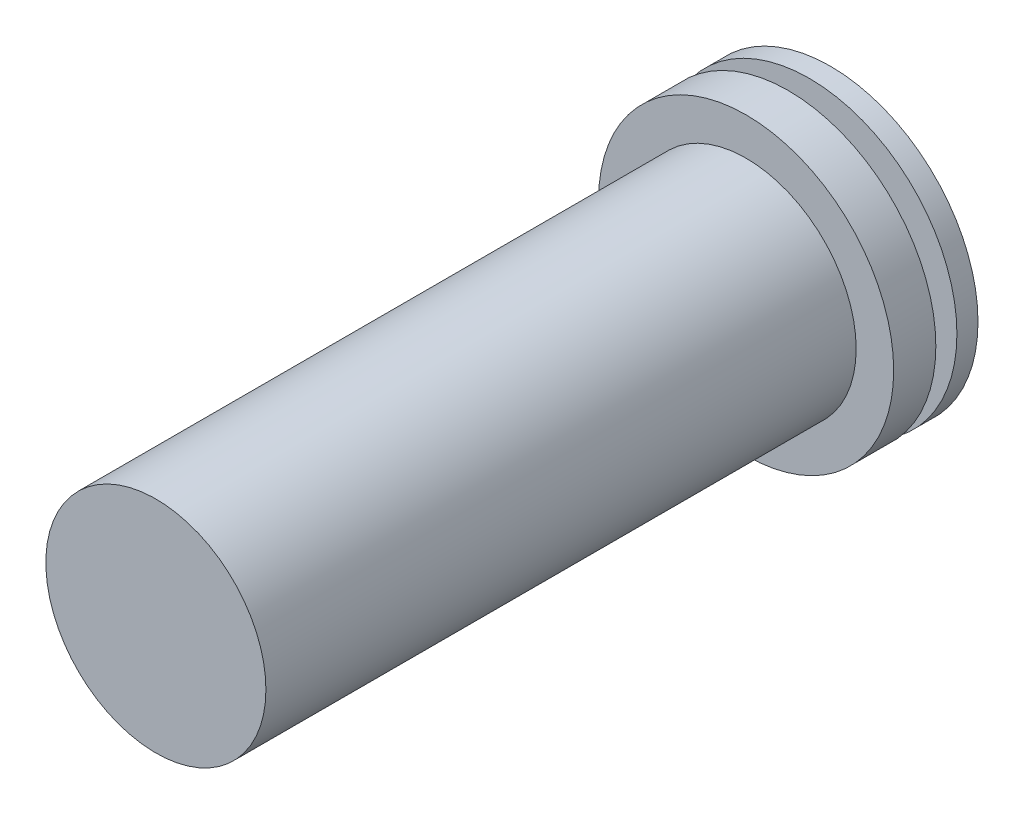
ISO-10303-21;
HEADER;
FILE_DESCRIPTION(('STEP AP214'),'2;1');
FILE_NAME('part.step','',(''),(''),'','','');
FILE_SCHEMA(('AUTOMOTIVE_DESIGN { 1 0 10303 214 1 1 1 1 }'));
ENDSEC;
DATA;
#1=APPLICATION_CONTEXT('core data for automotive mechanical design processes');
#2=APPLICATION_PROTOCOL_DEFINITION('international standard','automotive_design',2000,#1);
#3=PRODUCT_CONTEXT('',#1,'mechanical');
#4=PRODUCT('Part','Part','',(#3));
#5=PRODUCT_RELATED_PRODUCT_CATEGORY('part','',(#4));
#6=PRODUCT_DEFINITION_FORMATION('','',#4);
#7=PRODUCT_DEFINITION_CONTEXT('part definition',#1,'design');
#8=PRODUCT_DEFINITION('design','',#6,#7);
#9=PRODUCT_DEFINITION_SHAPE('','',#8);
#10=(LENGTH_UNIT() NAMED_UNIT(*) SI_UNIT(.MILLI.,.METRE.));
#11=(NAMED_UNIT(*) PLANE_ANGLE_UNIT() SI_UNIT($,.RADIAN.));
#12=(NAMED_UNIT(*) SI_UNIT($,.STERADIAN.) SOLID_ANGLE_UNIT());
#13=UNCERTAINTY_MEASURE_WITH_UNIT(LENGTH_MEASURE(1.E-05),#10,'distance_accuracy_value','');
#14=(GEOMETRIC_REPRESENTATION_CONTEXT(3) GLOBAL_UNCERTAINTY_ASSIGNED_CONTEXT((#13)) GLOBAL_UNIT_ASSIGNED_CONTEXT((#10,
#11,#12)) REPRESENTATION_CONTEXT('',''));
#15=CARTESIAN_POINT('',(0.,0.,0.));
#16=DIRECTION('',(0.,0.,1.));
#17=DIRECTION('',(1.,0.,0.));
#18=AXIS2_PLACEMENT_3D('',#15,#16,#17);
#19=CARTESIAN_POINT('',(0.,0.,-4.));
#20=DIRECTION('',(0.,0.,1.));
#21=DIRECTION('',(1.,0.,0.));
#22=AXIS2_PLACEMENT_3D('',#19,#20,#21);
#23=CYLINDRICAL_SURFACE('',#22,7.);
#24=CARTESIAN_POINT('',(0.,0.,0.));
#25=DIRECTION('',(0.,0.,-1.));
#26=DIRECTION('',(-1.,0.,0.));
#27=AXIS2_PLACEMENT_3D('',#24,#25,#26);
#28=CIRCLE('',#27,7.);
#29=CARTESIAN_POINT('',(-7.,0.,0.));
#30=VERTEX_POINT('',#29);
#31=EDGE_CURVE('E70',#30,#30,#28,.T.);
#32=ORIENTED_EDGE('',*,*,#31,.T.);
#33=EDGE_LOOP('',(#32));
#34=FACE_BOUND('',#33,.T.);
#35=CARTESIAN_POINT('',(0.,0.,-2.));
#36=DIRECTION('',(0.,0.,-1.));
#37=DIRECTION('',(-1.,0.,0.));
#38=AXIS2_PLACEMENT_3D('',#35,#36,#37);
#39=CIRCLE('',#38,7.);
#40=CARTESIAN_POINT('',(-7.,0.,-2.));
#41=VERTEX_POINT('',#40);
#42=EDGE_CURVE('E81',#41,#41,#39,.T.);
#43=ORIENTED_EDGE('',*,*,#42,.F.);
#44=EDGE_LOOP('',(#43));
#45=FACE_BOUND('',#44,.T.);
#46=ADVANCED_FACE('F55',(#34,#45),#23,.T.);
#47=CARTESIAN_POINT('',(0.,0.,28.));
#48=DIRECTION('',(0.,0.,-1.));
#49=DIRECTION('',(-1.,0.,0.));
#50=AXIS2_PLACEMENT_3D('',#47,#48,#49);
#51=CYLINDRICAL_SURFACE('',#50,5.22);
#52=CARTESIAN_POINT('',(0.,0.,28.));
#53=DIRECTION('',(0.,0.,1.));
#54=DIRECTION('',(1.,0.,0.));
#55=AXIS2_PLACEMENT_3D('',#52,#53,#54);
#56=CIRCLE('',#55,5.22);
#57=CARTESIAN_POINT('',(5.22,0.,28.));
#58=VERTEX_POINT('',#57);
#59=EDGE_CURVE('E11',#58,#58,#56,.T.);
#60=ORIENTED_EDGE('',*,*,#59,.F.);
#61=EDGE_LOOP('',(#60));
#62=FACE_BOUND('',#61,.T.);
#63=CARTESIAN_POINT('',(0.,0.,0.));
#64=DIRECTION('',(0.,0.,1.));
#65=DIRECTION('',(1.,0.,0.));
#66=AXIS2_PLACEMENT_3D('',#63,#64,#65);
#67=CIRCLE('',#66,5.22);
#68=CARTESIAN_POINT('',(5.22,0.,0.));
#69=VERTEX_POINT('',#68);
#70=EDGE_CURVE('E59',#69,#69,#67,.T.);
#71=ORIENTED_EDGE('',*,*,#70,.T.);
#72=EDGE_LOOP('',(#71));
#73=FACE_BOUND('',#72,.T.);
#74=ADVANCED_FACE('F57',(#62,#73),#51,.T.);
#75=CARTESIAN_POINT('',(0.,0.,28.));
#76=DIRECTION('',(0.,0.,1.));
#77=DIRECTION('',(1.,0.,0.));
#78=AXIS2_PLACEMENT_3D('',#75,#76,#77);
#79=PLANE('',#78);
#80=ORIENTED_EDGE('',*,*,#59,.T.);
#81=EDGE_LOOP('',(#80));
#82=FACE_BOUND('',#81,.T.);
#83=ADVANCED_FACE('F112',(#82),#79,.T.);
#84=CARTESIAN_POINT('',(0.,0.,0.));
#85=DIRECTION('',(0.,0.,-1.));
#86=DIRECTION('',(-1.,0.,0.));
#87=AXIS2_PLACEMENT_3D('',#84,#85,#86);
#88=PLANE('',#87);
#89=ORIENTED_EDGE('',*,*,#70,.F.);
#90=EDGE_LOOP('',(#89));
#91=FACE_BOUND('',#90,.T.);
#92=ORIENTED_EDGE('',*,*,#31,.F.);
#93=EDGE_LOOP('',(#92));
#94=FACE_BOUND('',#93,.T.);
#95=ADVANCED_FACE('F101',(#91,#94),#88,.F.);
#96=CARTESIAN_POINT('',(0.,0.,-2.));
#97=DIRECTION('',(0.,0.,-1.));
#98=DIRECTION('',(-1.,0.,0.));
#99=AXIS2_PLACEMENT_3D('',#96,#97,#98);
#100=PLANE('',#99);
#101=CARTESIAN_POINT('',(0.,0.,-2.));
#102=DIRECTION('',(0.,0.,-1.));
#103=DIRECTION('',(-1.,0.,0.));
#104=AXIS2_PLACEMENT_3D('',#101,#102,#103);
#105=CIRCLE('',#104,5.165);
#106=CARTESIAN_POINT('',(-5.165,0.,-2.));
#107=VERTEX_POINT('',#106);
#108=EDGE_CURVE('E89',#107,#107,#105,.T.);
#109=ORIENTED_EDGE('',*,*,#108,.F.);
#110=EDGE_LOOP('',(#109));
#111=FACE_BOUND('',#110,.T.);
#112=ORIENTED_EDGE('',*,*,#42,.T.);
#113=EDGE_LOOP('',(#112));
#114=FACE_BOUND('',#113,.T.);
#115=ADVANCED_FACE('F97',(#111,#114),#100,.T.);
#116=CARTESIAN_POINT('',(0.,0.,-3.));
#117=DIRECTION('',(0.,0.,-1.));
#118=DIRECTION('',(-1.,0.,0.));
#119=AXIS2_PLACEMENT_3D('',#116,#117,#118);
#120=PLANE('',#119);
#121=CARTESIAN_POINT('',(0.,0.,-3.));
#122=DIRECTION('',(0.,0.,-1.));
#123=DIRECTION('',(-1.,0.,0.));
#124=AXIS2_PLACEMENT_3D('',#121,#122,#123);
#125=CIRCLE('',#124,5.165);
#126=CARTESIAN_POINT('',(-5.165,0.,-3.));
#127=VERTEX_POINT('',#126);
#128=EDGE_CURVE('E85',#127,#127,#125,.T.);
#129=ORIENTED_EDGE('',*,*,#128,.T.);
#130=EDGE_LOOP('',(#129));
#131=FACE_BOUND('',#130,.T.);
#132=CARTESIAN_POINT('',(0.,0.,-3.));
#133=DIRECTION('',(0.,0.,-1.));
#134=DIRECTION('',(-1.,0.,0.));
#135=AXIS2_PLACEMENT_3D('',#132,#133,#134);
#136=CIRCLE('',#135,7.);
#137=CARTESIAN_POINT('',(-7.,0.,-3.));
#138=VERTEX_POINT('',#137);
#139=EDGE_CURVE('E74',#138,#138,#136,.T.);
#140=ORIENTED_EDGE('',*,*,#139,.F.);
#141=EDGE_LOOP('',(#140));
#142=FACE_BOUND('',#141,.T.);
#143=ADVANCED_FACE('F100',(#131,#142),#120,.F.);
#144=CARTESIAN_POINT('',(0.,0.,-2.));
#145=DIRECTION('',(0.,0.,-1.));
#146=DIRECTION('',(-1.,0.,0.));
#147=AXIS2_PLACEMENT_3D('',#144,#145,#146);
#148=CYLINDRICAL_SURFACE('',#147,5.165);
#149=ORIENTED_EDGE('',*,*,#108,.T.);
#150=EDGE_LOOP('',(#149));
#151=FACE_BOUND('',#150,.T.);
#152=ORIENTED_EDGE('',*,*,#128,.F.);
#153=EDGE_LOOP('',(#152));
#154=FACE_BOUND('',#153,.T.);
#155=ADVANCED_FACE('F94',(#151,#154),#148,.T.);
#156=CARTESIAN_POINT('',(0.,0.,-4.));
#157=DIRECTION('',(0.,0.,-1.));
#158=DIRECTION('',(-1.,0.,0.));
#159=AXIS2_PLACEMENT_3D('',#156,#157,#158);
#160=PLANE('',#159);
#161=CARTESIAN_POINT('',(0.,0.,-4.));
#162=DIRECTION('',(0.,0.,-1.));
#163=DIRECTION('',(-1.,0.,0.));
#164=AXIS2_PLACEMENT_3D('',#161,#162,#163);
#165=CIRCLE('',#164,7.);
#166=CARTESIAN_POINT('',(-7.,0.,-4.));
#167=VERTEX_POINT('',#166);
#168=EDGE_CURVE('E68',#167,#167,#165,.T.);
#169=ORIENTED_EDGE('',*,*,#168,.T.);
#170=EDGE_LOOP('',(#169));
#171=FACE_BOUND('',#170,.T.);
#172=ADVANCED_FACE('F116',(#171),#160,.T.);
#173=ORIENTED_EDGE('',*,*,#139,.T.);
#174=EDGE_LOOP('',(#173));
#175=FACE_BOUND('',#174,.T.);
#176=ORIENTED_EDGE('',*,*,#168,.F.);
#177=EDGE_LOOP('',(#176));
#178=FACE_BOUND('',#177,.T.);
#179=ADVANCED_FACE('F108',(#175,#178),#23,.T.);
#180=CLOSED_SHELL('',(#46,#74,#83,#95,#115,#143,#155,#172,#179));
#181=MANIFOLD_SOLID_BREP('B2',#180);
#182=ADVANCED_BREP_SHAPE_REPRESENTATION('',(#18,#181),#14);
#183=SHAPE_DEFINITION_REPRESENTATION(#9,#182);
ENDSEC;
END-ISO-10303-21;
